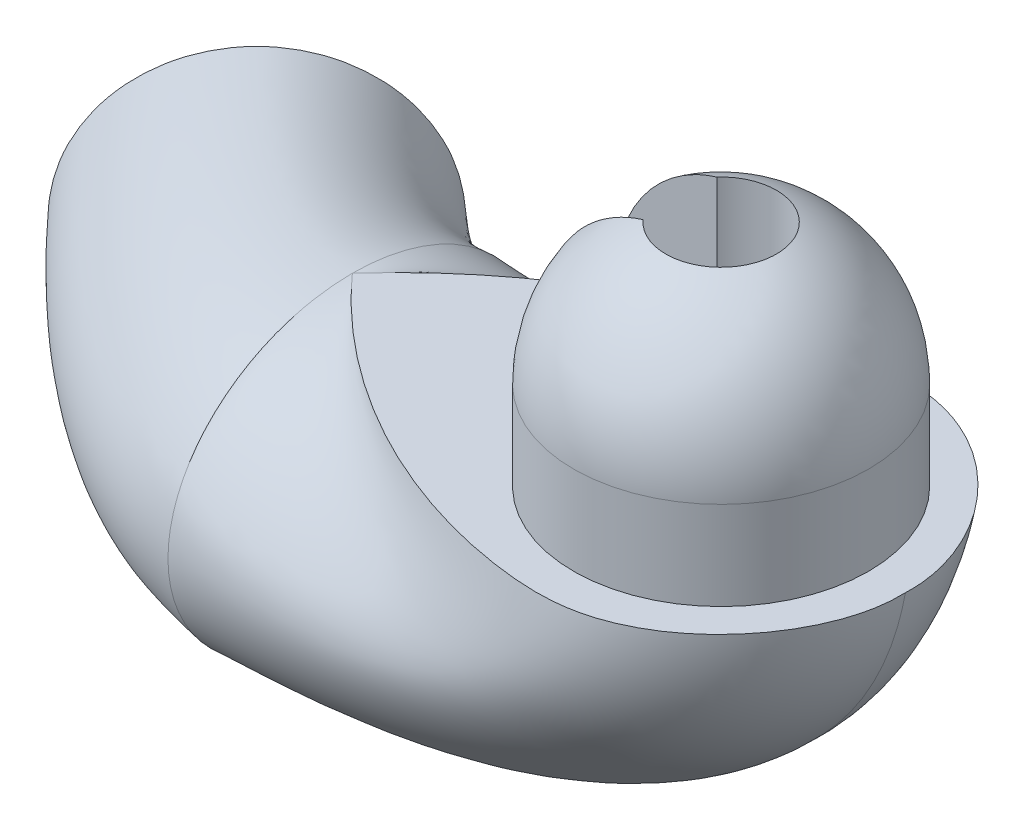
ISO-10303-21;
HEADER;
FILE_DESCRIPTION(('STEP AP214'),'2;1');
FILE_NAME('part.step','',(''),(''),'','','');
FILE_SCHEMA(('AUTOMOTIVE_DESIGN { 1 0 10303 214 1 1 1 1 }'));
ENDSEC;
DATA;
#1=APPLICATION_CONTEXT('core data for automotive mechanical design processes');
#2=APPLICATION_PROTOCOL_DEFINITION('international standard','automotive_design',2000,#1);
#3=PRODUCT_CONTEXT('',#1,'mechanical');
#4=PRODUCT('Part','Part','',(#3));
#5=PRODUCT_RELATED_PRODUCT_CATEGORY('part','',(#4));
#6=PRODUCT_DEFINITION_FORMATION('','',#4);
#7=PRODUCT_DEFINITION_CONTEXT('part definition',#1,'design');
#8=PRODUCT_DEFINITION('design','',#6,#7);
#9=PRODUCT_DEFINITION_SHAPE('','',#8);
#10=(LENGTH_UNIT() NAMED_UNIT(*) SI_UNIT(.MILLI.,.METRE.));
#11=(NAMED_UNIT(*) PLANE_ANGLE_UNIT() SI_UNIT($,.RADIAN.));
#12=(NAMED_UNIT(*) SI_UNIT($,.STERADIAN.) SOLID_ANGLE_UNIT());
#13=UNCERTAINTY_MEASURE_WITH_UNIT(LENGTH_MEASURE(1.E-05),#10,'distance_accuracy_value','');
#14=(GEOMETRIC_REPRESENTATION_CONTEXT(3) GLOBAL_UNCERTAINTY_ASSIGNED_CONTEXT((#13)) GLOBAL_UNIT_ASSIGNED_CONTEXT((#10,
#11,#12)) REPRESENTATION_CONTEXT('',''));
#15=CARTESIAN_POINT('',(0.,0.,0.));
#16=DIRECTION('',(0.,0.,1.));
#17=DIRECTION('',(1.,0.,0.));
#18=AXIS2_PLACEMENT_3D('',#15,#16,#17);
#19=CARTESIAN_POINT('',(4.73507473245652,0.,4.98936116941505));
#20=DIRECTION('',(0.,1.,0.));
#21=DIRECTION('',(0.,0.,-1.));
#22=AXIS2_PLACEMENT_3D('',#19,#20,#21);
#23=PLANE('',#22);
#24=CARTESIAN_POINT('',(5.,0.,2.5));
#25=DIRECTION('',(0.,-1.,0.));
#26=DIRECTION('',(0.,0.,-1.));
#27=AXIS2_PLACEMENT_3D('',#24,#25,#26);
#28=CIRCLE('',#27,2.);
#29=CARTESIAN_POINT('',(3.06350832689629,0.,2.));
#30=VERTEX_POINT('',#29);
#31=CARTESIAN_POINT('',(3.06350832689629,0.,3.));
#32=VERTEX_POINT('',#31);
#33=EDGE_CURVE('E109',#30,#32,#28,.T.);
#34=ORIENTED_EDGE('',*,*,#33,.T.);
#35=DIRECTION('',(1.,0.,0.));
#36=VECTOR('',#35,1.);
#37=CARTESIAN_POINT('',(2.6790228958727,0.,3.));
#38=LINE('',#37,#36);
#39=CARTESIAN_POINT('',(4.44098300562505,0.,3.));
#40=VERTEX_POINT('',#39);
#41=EDGE_CURVE('E93',#32,#40,#38,.T.);
#42=ORIENTED_EDGE('',*,*,#41,.T.);
#43=CARTESIAN_POINT('',(5.,0.,2.5));
#44=DIRECTION('',(0.,1.,0.));
#45=DIRECTION('',(0.,0.,1.));
#46=AXIS2_PLACEMENT_3D('',#43,#44,#45);
#47=CIRCLE('',#46,0.75);
#48=CARTESIAN_POINT('',(4.44098300562505,0.,2.));
#49=VERTEX_POINT('',#48);
#50=EDGE_CURVE('E101',#40,#49,#47,.T.);
#51=ORIENTED_EDGE('',*,*,#50,.T.);
#52=DIRECTION('',(-1.,0.,0.));
#53=VECTOR('',#52,1.);
#54=CARTESIAN_POINT('',(4.44098300562505,0.,2.));
#55=LINE('',#54,#53);
#56=EDGE_CURVE('E98',#49,#30,#55,.T.);
#57=ORIENTED_EDGE('',*,*,#56,.T.);
#58=EDGE_LOOP('',(#34,#42,#51,#57));
#59=FACE_BOUND('',#58,.T.);
#60=CARTESIAN_POINT('',(7.5,0.,2.49999999999999));
#61=CARTESIAN_POINT('',(7.50823058996346,0.,2.68160312823165));
#62=CARTESIAN_POINT('',(7.46344380636916,0.,3.02850424136115));
#63=CARTESIAN_POINT('',(7.23330123988562,0.,3.64143178730474));
#64=CARTESIAN_POINT('',(6.86621771406725,0.,4.14920933028272));
#65=CARTESIAN_POINT('',(6.39822178057757,0.,4.55577936255793));
#66=CARTESIAN_POINT('',(5.99170763089045,0.,4.79874490778828));
#67=CARTESIAN_POINT('',(5.52857314560845,0.,4.96506001367999));
#68=CARTESIAN_POINT('',(5.1817895453393,0.,5.));
#69=CARTESIAN_POINT('',(4.78000040421905,0.,5.));
#70=CARTESIAN_POINT('',(4.32877073926575,0.,4.95378775654363));
#71=CARTESIAN_POINT('',(3.63304559323961,0.,4.80332689979681));
#72=CARTESIAN_POINT('',(2.93444095803466,0.,4.56768487752718));
#73=CARTESIAN_POINT('',(2.0225358724664,0.,4.15441549125842));
#74=CARTESIAN_POINT('',(0.969478991949337,0.,3.47175607058277));
#75=CARTESIAN_POINT('',(0.293338087820461,0.,2.82795129944699));
#76=CARTESIAN_POINT('',(0.,0.,2.5));
#77=B_SPLINE_CURVE_WITH_KNOTS('',3,(#60,#61,#62,#63,#64,#65,#66,#67,#68,#69,#70,#71,#72,#73,#74,
#75,#76),.UNSPECIFIED.,.F.,.F.,(4,1,1,1,1,1,1,2,1,1,1,1,1,4),(0.,0.0565562756208527,
0.113112551241705,0.226225102483411,0.282781378104263,0.339337653725116,0.395893929345969,
0.452450204966821,0.520893929345969,0.589337653725116,0.657781378104263,0.726225102483411,
0.863112551241705,1.),.UNSPECIFIED.);
#78=CARTESIAN_POINT('',(0.,1.2928250840123E-08,2.49971507284762));
#79=VERTEX_POINT('',#78);
#80=CARTESIAN_POINT('',(7.5,0.,2.5));
#81=VERTEX_POINT('',#80);
#82=EDGE_CURVE('E132',#79,#81,#77,.F.);
#83=ORIENTED_EDGE('',*,*,#82,.T.);
#84=CARTESIAN_POINT('',(0.,0.,2.5));
#85=CARTESIAN_POINT('',(0.293338103829924,0.,2.17204868265447));
#86=CARTESIAN_POINT('',(0.96947906081587,0.,1.52824387361764));
#87=CARTESIAN_POINT('',(2.0225358825626,0.,0.845584510287323));
#88=CARTESIAN_POINT('',(2.93444092301905,0.,0.432315135350582));
#89=CARTESIAN_POINT('',(3.63304553826115,0.,0.196673117505334));
#90=CARTESIAN_POINT('',(4.3287706849955,0.,0.0462122499199591));
#91=CARTESIAN_POINT('',(4.78000039221216,0.,0.));
#92=CARTESIAN_POINT('',(5.18178952789119,0.,0.));
#93=CARTESIAN_POINT('',(5.52857310613618,0.,0.0349399784608431));
#94=CARTESIAN_POINT('',(5.99170759816834,0.,0.201255075385112));
#95=CARTESIAN_POINT('',(6.39822176321519,0.,0.444220623691196));
#96=CARTESIAN_POINT('',(6.86621772138046,0.,0.850790673414314));
#97=CARTESIAN_POINT('',(7.23330125921473,0.,1.35856824306579));
#98=CARTESIAN_POINT('',(7.46344381568126,0.,1.97149579834312));
#99=CARTESIAN_POINT('',(7.50823058917349,0.,2.31839688919857));
#100=CARTESIAN_POINT('',(7.5,0.,2.50000000000001));
#101=B_SPLINE_CURVE_WITH_KNOTS('',3,(#84,#85,#86,#87,#88,#89,#90,#91,#92,#93,#94,#95,#96,#97,
#98,#99,#100),.UNSPECIFIED.,.F.,.F.,(4,1,1,1,1,1,2,1,1,1,1,1,1,4),(0.,0.136887461139135,
0.273774922278271,0.342218652847838,0.410662383417406,0.479106113986974,0.547549844556541,
0.604106113986974,0.660662383417406,0.717218652847838,0.773774922278271,0.886887461139135,
0.943443730569568,1.),.UNSPECIFIED.);
#102=EDGE_CURVE('E123',#81,#79,#101,.F.);
#103=ORIENTED_EDGE('',*,*,#102,.T.);
#104=EDGE_LOOP('',(#83,#103));
#105=FACE_BOUND('',#104,.T.);
#106=ADVANCED_FACE('F32',(#59,#105),#23,.T.);
#107=CARTESIAN_POINT('',(-3.31225624165787,-2.,0.483829116911674));
#108=DIRECTION('',(0.707106781186546,0.,0.707106781186549));
#109=DIRECTION('',(0.707106781186549,0.,-0.707106781186546));
#110=AXIS2_PLACEMENT_3D('',#107,#108,#109);
#111=PLANE('',#110);
#112=CARTESIAN_POINT('',(-3.31225624165787,-2.,0.483829116911674));
#113=DIRECTION('',(-0.707106781186546,0.,-0.707106781186549));
#114=DIRECTION('',(-0.707106781186549,0.,0.707106781186546));
#115=AXIS2_PLACEMENT_3D('',#112,#113,#114);
#116=ELLIPSE('',#115,2.,2.);
#117=CARTESIAN_POINT('',(-4.72646980403097,-2.,1.89804267928477));
#118=VERTEX_POINT('',#117);
#119=EDGE_CURVE('E259',#118,#118,#116,.T.);
#120=ORIENTED_EDGE('',*,*,#119,.T.);
#121=EDGE_LOOP('',(#120));
#122=FACE_BOUND('',#121,.T.);
#123=CARTESIAN_POINT('',(-3.31225624165787,-2.,0.483829116911674));
#124=DIRECTION('',(-0.707106781186546,0.,-0.707106781186549));
#125=DIRECTION('',(0.707106781186549,0.,-0.707106781186546));
#126=AXIS2_PLACEMENT_3D('',#123,#124,#125);
#127=CIRCLE('',#126,1.125);
#128=CARTESIAN_POINT('',(-2.516761112823,-2.,-0.31166601192319));
#129=VERTEX_POINT('',#128);
#130=EDGE_CURVE('E124',#129,#129,#127,.T.);
#131=ORIENTED_EDGE('',*,*,#130,.F.);
#132=EDGE_LOOP('',(#131));
#133=FACE_BOUND('',#132,.T.);
#134=ADVANCED_FACE('F204',(#122,#133),#111,.F.);
#135=CARTESIAN_POINT('',(0.,-4.2,2.49999997011014));
#136=CARTESIAN_POINT('',(-0.146742611688297,-4.20286550461975,2.48179723035606));
#137=CARTESIAN_POINT('',(-1.12222066506903,-4.1789003750892,2.30069532329818));
#138=CARTESIAN_POINT('',(-1.95948753838525,-4.17445859906967,2.03247373475735));
#139=CARTESIAN_POINT('',(-3.31225624165787,-4.,0.483829116911673));
#140=CARTESIAN_POINT('',(0.,-4.2,2.19836129227853));
#141=CARTESIAN_POINT('',(-0.139655756541813,-4.20286550461975,2.18406290197288));
#142=CARTESIAN_POINT('',(-1.04755878022122,-4.1789003750892,2.04365442456356));
#143=CARTESIAN_POINT('',(-1.82449953616029,-4.17445859906967,1.8156706481727));
#144=CARTESIAN_POINT('',(-3.12713612960674,-4.,0.298709004860543));
#145=CARTESIAN_POINT('',(0.,-4.10833507935549,1.59472909886228));
#146=CARTESIAN_POINT('',(-0.120973982876845,-4.11002144089427,1.58594662839158));
#147=CARTESIAN_POINT('',(-0.904573863692059,-4.08061234565118,1.50178683907874));
#148=CARTESIAN_POINT('',(-1.55258827534835,-4.06638287744619,1.33493326701403));
#149=CARTESIAN_POINT('',(-2.75696375909292,-3.89598215796163,-0.0714633656532701));
#150=CARTESIAN_POINT('',(0.,-3.69371629660239,0.776500214039875));
#151=CARTESIAN_POINT('',(-0.0893458189282706,-3.69209060756782,0.772432772687611));
#152=CARTESIAN_POINT('',(-0.733092205662598,-3.64860340188294,0.733123212621852));
#153=CARTESIAN_POINT('',(-1.20291843988814,-3.6072646438174,0.627302127550897));
#154=CARTESIAN_POINT('',(-2.2861976535332,-3.45106597111442,-0.542229471213002));
#155=CARTESIAN_POINT('',(0.,-3.00272511026058,0.160766285967962));
#156=CARTESIAN_POINT('',(-0.063610221964274,-2.99963819662749,0.159854172326594));
#157=CARTESIAN_POINT('',(-0.623958643141196,-2.96058114025006,0.148560376060056));
#158=CARTESIAN_POINT('',(-0.966615544216336,-2.91064135207322,0.0872790256589414));
#159=CARTESIAN_POINT('',(-1.97159440075428,-2.78530215992626,-0.856832723991904));
#160=CARTESIAN_POINT('',(0.,-2.40163870772189,0.));
#161=CARTESIAN_POINT('',(-0.0561900803845833,-2.40037053557888,-0.000301631636904407));
#162=CARTESIAN_POINT('',(-0.599911396905172,-2.38584835920112,-0.00687602085754774));
#163=CARTESIAN_POINT('',(-0.910444623419121,-2.35609972455105,-0.0578730217352386));
#164=CARTESIAN_POINT('',(-1.89804267928477,-2.26179937313036,-0.930384445461419));
#165=CARTESIAN_POINT('',(0.,-1.7983613221811,0.));
#166=CARTESIAN_POINT('',(-0.0561900803845833,-1.79974910381625,-0.000301631636904211));
#167=CARTESIAN_POINT('',(-0.599911396905172,-1.81178646522161,-0.00687602085754752));
#168=CARTESIAN_POINT('',(-0.910444623419121,-1.80859736835465,-0.0578730217352383));
#169=CARTESIAN_POINT('',(-1.89804267928477,-1.73820060093892,-0.930384445461418));
#170=CARTESIAN_POINT('',(0.,-1.19727492933299,0.160766259464055));
#171=CARTESIAN_POINT('',(-0.0548917199946969,-1.20082468843853,0.162729750023182));
#172=CARTESIAN_POINT('',(-0.593725373143239,-1.2347118814175,0.171075370974304));
#173=CARTESIAN_POINT('',(-0.973911339668054,-1.25527592340819,0.0503136387346895));
#174=CARTESIAN_POINT('',(-1.97159441350193,-1.21469780349391,-0.856832711244266));
#175=CARTESIAN_POINT('',(0.,-0.506283697054256,0.776500209636346));
#176=CARTESIAN_POINT('',(-0.054471809498738,-0.509401944448522,0.783935180112972));
#177=CARTESIAN_POINT('',(-0.61215910848492,-0.539664190919537,0.823183239125599));
#178=CARTESIAN_POINT('',(-1.23210158860519,-0.56231320825439,0.479440576925317));
#179=CARTESIAN_POINT('',(-2.28619765696574,-0.548934033738167,-0.542229467780446));
#180=CARTESIAN_POINT('',(0.,-0.0916649048201302,1.5947291423194));
#181=CARTESIAN_POINT('',(-0.0599444653893786,-0.0925008123711799,1.60607588977972));
#182=CARTESIAN_POINT('',(-0.692940932512134,-0.100629831013785,1.6593919060208));
#183=CARTESIAN_POINT('',(-1.60365876374493,-0.106855542372347,1.07617554618459));
#184=CARTESIAN_POINT('',(-2.75696373322839,-0.104017860065657,-0.0714633915178119));
#185=CARTESIAN_POINT('',(0.,0.,2.1983613221807));
#186=CARTESIAN_POINT('',(-0.0699077370469979,0.,2.20706775339796));
#187=CARTESIAN_POINT('',(-0.805692578138338,0.,2.2237744924289));
#188=CARTESIAN_POINT('',(-1.88286581715893,0.,1.51994754016445));
#189=CARTESIAN_POINT('',(-3.12713611127149,0.,0.298708986525293));
#190=CARTESIAN_POINT('',(0.,0.,2.80163870772319));
#191=CARTESIAN_POINT('',(-0.0840814480419639,0.,2.80253643965677));
#192=CARTESIAN_POINT('',(-0.955016355229448,0.,2.73785631535882));
#193=CARTESIAN_POINT('',(-2.15284183497922,0.,1.95355373480779));
#194=CARTESIAN_POINT('',(-3.49737635370901,0.,0.668949228962813));
#195=CARTESIAN_POINT('',(0.,-0.0916649206455884,3.4052709011433));
#196=CARTESIAN_POINT('',(-0.0875872606806623,-0.0924571178085326,3.40131011932424));
#197=CARTESIAN_POINT('',(-0.977480993420405,-0.100186966034652,3.29493919639107));
#198=CARTESIAN_POINT('',(-2.32620520636502,-0.107938520074303,2.5310945458628));
#199=CARTESIAN_POINT('',(-3.86754872422255,-0.104017842038337,1.03912159947635));
#200=CARTESIAN_POINT('',(0.,-0.506283703404131,4.22349978597012));
#201=CARTESIAN_POINT('',(-0.0736875415503121,-0.509227113386236,4.21679619327979));
#202=CARTESIAN_POINT('',(-0.787401816434423,-0.53789271959392,4.10924870948619));
#203=CARTESIAN_POINT('',(-2.38023137354631,-0.566645149055742,3.52913597501362));
#204=CARTESIAN_POINT('',(-4.33831482978188,-0.548934028884766,1.50988770503568));
#205=CARTESIAN_POINT('',(0.,-1.19727488975452,4.83923371404141));
#206=CARTESIAN_POINT('',(-0.0538952554353766,-1.20051868658087,4.83134701188757));
#207=CARTESIAN_POINT('',(-0.534974543940408,-1.23161179101987,4.73945743268341));
#208=CARTESIAN_POINT('',(-2.32089060093949,-1.26285683615362,4.3595693665924));
#209=CARTESIAN_POINT('',(-4.65291808256107,-1.21469784007231,1.82449095781486));
#210=CARTESIAN_POINT('',(0.,-1.79836129229778,5.00000000000351));
#211=CARTESIAN_POINT('',(-0.0461394359887617,-1.79939940171593,4.99216022192788));
#212=CARTESIAN_POINT('',(-0.438501511838035,-1.80824350866791,4.91010912514281));
#213=CARTESIAN_POINT('',(-2.27851363231067,-1.81726126212817,4.60152484388083));
#214=CARTESIAN_POINT('',(-4.72646980403097,-1.73820062686889,1.89804267928477));
#215=CARTESIAN_POINT('',(0.,-2.40163867783856,4.99999999999649));
#216=CARTESIAN_POINT('',(-0.0461394359887617,-2.40002083347856,4.99216022192112));
#217=CARTESIAN_POINT('',(-0.438501511838035,-2.38230540264743,4.91010912513858));
#218=CARTESIAN_POINT('',(-2.27851363231067,-2.36476361832457,4.60152484387891));
#219=CARTESIAN_POINT('',(-4.72646980403097,-2.26179939906034,1.89804267928477));
#220=CARTESIAN_POINT('',(0.,-3.00272507068211,4.83923374052658));
#221=CARTESIAN_POINT('',(-0.0626137574049408,-2.99933219476982,4.82847143417294));
#222=CARTESIAN_POINT('',(-0.565207813938365,-2.95748104985242,4.71694243775809));
#223=CARTESIAN_POINT('',(-2.31359480548809,-2.91822226481865,4.3965347535121));
#224=CARTESIAN_POINT('',(-4.65291806981422,-2.78530219650464,1.82449094506801));
#225=CARTESIAN_POINT('',(0.,-3.69371630295224,4.22349979035368));
#226=CARTESIAN_POINT('',(-0.108561550979761,-3.69191577650552,4.20529378583522));
#227=CARTESIAN_POINT('',(-0.908334913611638,-3.64683193055731,4.01918868297089));
#228=CARTESIAN_POINT('',(-2.35104822482944,-3.61159658461875,3.67699752563491));
#229=CARTESIAN_POINT('',(-4.33831482635066,-3.45106596626102,1.50988770160447));
#230=CARTESIAN_POINT('',(0.,-4.10833509518095,3.40527085767503));
#231=CARTESIAN_POINT('',(-0.148616778167991,-4.10997774633162,3.38118085792536));
#232=CARTESIAN_POINT('',(-1.18911392459937,-4.08016948067204,3.13733412944258));
#233=CARTESIAN_POINT('',(-2.2751347179679,-4.06746585514814,2.78985226668994));
#234=CARTESIAN_POINT('',(-3.86754875008765,-3.8959821399343,1.03912162534144));
#235=CARTESIAN_POINT('',(0.,-4.2,2.80163867781761));
#236=CARTESIAN_POINT('',(-0.1538294675367,-4.20286550461975,2.77953158822839));
#237=CARTESIAN_POINT('',(-1.19688255731175,-4.1789003750892,2.55773624749147));
#238=CARTESIAN_POINT('',(-2.09447555398012,-4.17445859906967,2.2492768428153));
#239=CARTESIAN_POINT('',(-3.49737637204426,-4.,0.668949247298062));
#240=CARTESIAN_POINT('',(0.,-4.2,2.49999997011014));
#241=CARTESIAN_POINT('',(-0.146742611688297,-4.20286550461975,2.48179723035606));
#242=CARTESIAN_POINT('',(-1.12222066506903,-4.1789003750892,2.30069532329818));
#243=CARTESIAN_POINT('',(-1.95948753838525,-4.17445859906967,2.03247373475735));
#244=CARTESIAN_POINT('',(-3.31225624165787,-4.,0.483829116911673));
#245=B_SPLINE_SURFACE_WITH_KNOTS('',3,3,((#135,#136,#137,#138,#139),(#140,#141,#142,#143,#144),
(#145,#146,#147,#148,#149),(#150,#151,#152,#153,#154),(#155,#156,#157,#158,#159),(#160,#161,
#162,#163,#164),(#165,#166,#167,#168,#169),(#170,#171,#172,#173,#174),(#175,#176,#177,#178,
#179),(#180,#181,#182,#183,#184),(#185,#186,#187,#188,#189),(#190,#191,#192,#193,#194),(#195,
#196,#197,#198,#199),(#200,#201,#202,#203,#204),(#205,#206,#207,#208,#209),(#210,#211,#212,#213,
#214),(#215,#216,#217,#218,#219),(#220,#221,#222,#223,#224),(#225,#226,#227,#228,#229),(#230,
#231,#232,#233,#234),(#235,#236,#237,#238,#239),(#240,#241,#242,#243,#244)),.UNSPECIFIED.,.T.,
.F.,.F.,(4,1,1,1,2,1,1,1,2,1,1,1,2,1,1,1,4),(4,1,4),(0.,0.0624999969047489,0.124999993809498,
0.187499990714247,0.249999987618996,0.312499990714247,0.374999993809498,0.437499996904749,
0.500000000000001,0.562499996904927,0.624999993809853,0.687499990714779,0.749999987619705,
0.812499990714778,0.874999993809852,0.937499996904926,1.),(0.,0.0999999999941863,1.),.UNSPECIFIED.);
#246=CARTESIAN_POINT('',(0.,-2.1,2.5));
#247=DIRECTION('',(-1.,0.,0.));
#248=DIRECTION('',(0.,0.,-1.));
#249=AXIS2_PLACEMENT_3D('',#246,#247,#248);
#250=ELLIPSE('',#249,2.5,2.1);
#251=CARTESIAN_POINT('',(0.,-4.2,2.49999998505507));
#252=VERTEX_POINT('',#251);
#253=EDGE_CURVE('E186',#252,#79,#250,.T.);
#254=CARTESIAN_POINT('',(0.,-4.2,2.49999997011014));
#255=CARTESIAN_POINT('',(0.,-4.2,2.80163867781761));
#256=CARTESIAN_POINT('',(0.,-4.10833509518095,3.40527085767503));
#257=CARTESIAN_POINT('',(0.,-3.69371630295224,4.22349979035368));
#258=CARTESIAN_POINT('',(0.,-3.00272507068211,4.83923374052658));
#259=CARTESIAN_POINT('',(0.,-2.40163867783856,4.99999999999649));
#260=CARTESIAN_POINT('',(0.,-1.79836129229778,5.00000000000351));
#261=CARTESIAN_POINT('',(0.,-1.19727488975452,4.83923371404141));
#262=CARTESIAN_POINT('',(0.,-0.506283703404131,4.22349978597012));
#263=CARTESIAN_POINT('',(0.,-0.0916649206455884,3.4052709011433));
#264=CARTESIAN_POINT('',(0.,0.,2.80163870772319));
#265=CARTESIAN_POINT('',(0.,0.,2.1983613221807));
#266=CARTESIAN_POINT('',(0.,-0.0916649048201302,1.5947291423194));
#267=CARTESIAN_POINT('',(0.,-0.506283697054256,0.776500209636346));
#268=CARTESIAN_POINT('',(0.,-1.19727492933299,0.160766259464055));
#269=CARTESIAN_POINT('',(0.,-1.7983613221811,0.));
#270=CARTESIAN_POINT('',(0.,-2.40163870772189,0.));
#271=CARTESIAN_POINT('',(0.,-3.00272511026058,0.160766285967962));
#272=CARTESIAN_POINT('',(0.,-3.69371629660239,0.776500214039875));
#273=CARTESIAN_POINT('',(0.,-4.10833507935549,1.59472909886228));
#274=CARTESIAN_POINT('',(0.,-4.2,2.19836129227853));
#275=CARTESIAN_POINT('',(0.,-4.2,2.49999997011014));
#276=B_SPLINE_CURVE_WITH_KNOTS('',3,(#254,#255,#256,#257,#258,#259,#260,#261,#262,#263,#264,
#265,#266,#267,#268,#269,#270,#271,#272,#273,#274,#275),.UNSPECIFIED.,.T.,.F.,(4,1,1,1,2,1,1,1,
2,1,1,1,2,1,1,1,4),(0.,0.0625000030950739,0.125000006190148,0.187500009285222,0.250000012380295,
0.312500009285221,0.375000006190147,0.437500003095073,0.499999999999999,0.562500003095251,
0.625000006190502,0.687500009285753,0.750000012381004,0.812500009285753,0.875000006190502,
0.937500003095251,1.),.UNSPECIFIED.);
#277=EDGE_CURVE('E61',#79,#252,#276,.T.);
#278=ORIENTED_EDGE('',*,*,#253,.T.);
#279=ORIENTED_EDGE('',*,*,#277,.T.);
#280=EDGE_LOOP('',(#278,#279));
#281=FACE_BOUND('',#280,.T.);
#282=ORIENTED_EDGE('',*,*,#119,.F.);
#283=EDGE_LOOP('',(#282));
#284=FACE_BOUND('',#283,.T.);
#285=ADVANCED_FACE('F152',(#281,#284),#245,.F.);
#286=CARTESIAN_POINT('',(0.,-4.2,2.5));
#287=CARTESIAN_POINT('',(0.105781777957206,-4.1979343547867,2.51312176002954));
#288=CARTESIAN_POINT('',(1.4192393709244,-4.14993393507288,2.64482044491097));
#289=CARTESIAN_POINT('',(7.08014247247718,-3.62406705762578,2.81743268927057));
#290=CARTESIAN_POINT('',(7.5,0.,2.49999999999999));
#291=CARTESIAN_POINT('',(0.,-4.2,2.63647647485788));
#292=CARTESIAN_POINT('',(0.106056130955982,-4.1979343547867,2.65110245666651));
#293=CARTESIAN_POINT('',(1.42225725391099,-4.14993393507288,2.7978433593392));
#294=CARTESIAN_POINT('',(7.08590388545159,-3.62406705762578,2.98549782149005));
#295=CARTESIAN_POINT('',(7.50823058996346,0.,2.68160312823165));
#296=CARTESIAN_POINT('',(0.,-4.18119654722982,2.91880778398276));
#297=CARTESIAN_POINT('',(0.105062778304238,-4.17765981231065,2.93544418715239));
#298=CARTESIAN_POINT('',(1.40708209944928,-4.11758558032943,3.10213750174085));
#299=CARTESIAN_POINT('',(7.03864678014114,-3.59229630136862,3.31488341729668));
#300=CARTESIAN_POINT('',(7.46344380636916,0.,3.02850424136115));
#301=CARTESIAN_POINT('',(0.,-4.0541916623502,3.5018464952999));
#302=CARTESIAN_POINT('',(0.100077603236646,-4.04439148571377,3.5187696657616));
#303=CARTESIAN_POINT('',(1.33042573047503,-3.9339482010934,3.68757164479663));
#304=CARTESIAN_POINT('',(6.79856320373426,-3.42208185181585,3.92812143224515));
#305=CARTESIAN_POINT('',(7.23330123988562,0.,3.64143178730474));
#306=CARTESIAN_POINT('',(0.,-3.77181355607381,4.08374332936444));
#307=CARTESIAN_POINT('',(0.0925919793533299,-3.75461268903872,4.09706061327724));
#308=CARTESIAN_POINT('',(1.21178539834615,-3.58757894107068,4.22858931326387));
#309=CARTESIAN_POINT('',(6.41654589772116,-3.12247312869072,4.47297815357775));
#310=CARTESIAN_POINT('',(6.86621771406725,0.,4.14920933028272));
#311=CARTESIAN_POINT('',(0.,-3.3296799989235,4.5481344861156));
#312=CARTESIAN_POINT('',(0.0828738673968581,-3.31035813985225,4.55838915569983));
#313=CARTESIAN_POINT('',(1.06511929680365,-3.13401055562439,4.65807729884168));
#314=CARTESIAN_POINT('',(5.96717793096125,-2.76615147855342,4.91173791422447));
#315=CARTESIAN_POINT('',(6.39822178057757,0.,4.55577936255793));
#316=CARTESIAN_POINT('',(0.,-2.94130297249896,4.81225005335053));
#317=CARTESIAN_POINT('',(0.0740670917902432,-2.92382790786801,4.82105471864605));
#318=CARTESIAN_POINT('',(0.939438068703537,-2.76944229469017,4.90544586000282));
#319=CARTESIAN_POINT('',(5.60527469917771,-2.49598304135778,5.17078944141887));
#320=CARTESIAN_POINT('',(5.99170763089045,0.,4.79874490778828));
#321=CARTESIAN_POINT('',(0.,-2.51924995438778,4.96676285858527));
#322=CARTESIAN_POINT('',(0.0634721055986542,-2.50785691195072,4.97542878850609));
#323=CARTESIAN_POINT('',(0.797857636650451,-2.40968965276874,5.05786331976034));
#324=CARTESIAN_POINT('',(5.23006278613679,-2.24831666848286,5.34052169665837));
#325=CARTESIAN_POINT('',(5.52857314560845,0.,4.96506001367999));
#326=CARTESIAN_POINT('',(0.,-2.2364764748784,4.99999999999841));
#327=CARTESIAN_POINT('',(0.0550517963726515,-2.23230521584915,5.00858078597704));
#328=CARTESIAN_POINT('',(0.692893025117255,-2.1961120436159,5.09001207611462));
#329=CARTESIAN_POINT('',(4.97907996660789,-2.11685355678739,5.37680625338512));
#330=CARTESIAN_POINT('',(5.1817895453393,0.,5.));
#331=CARTESIAN_POINT('',(0.,-1.9348377792685,5.00000000000192));
#332=CARTESIAN_POINT('',(0.044992551267927,-1.9405871078049,5.00858078598043));
#333=CARTESIAN_POINT('',(0.572020239230303,-1.98733177708318,5.09001207611705));
#334=CARTESIAN_POINT('',(4.70751710444612,-2.00046947300333,5.37680625338648));
#335=CARTESIAN_POINT('',(4.78000040421905,0.,5.));
#336=CARTESIAN_POINT('',(0.,-1.61841314093148,4.9539276381165));
#337=CARTESIAN_POINT('',(0.0363198271575806,-1.63240245463583,4.96223561181415));
#338=CARTESIAN_POINT('',(0.465641105292898,-1.74824317049256,5.04107554694384));
#339=CARTESIAN_POINT('',(4.35723299098797,-1.83945734114242,5.31886077898333));
#340=CARTESIAN_POINT('',(4.32877073926575,0.,4.95378775654363));
#341=CARTESIAN_POINT('',(0.,-1.19638420218133,4.77586220881276));
#342=CARTESIAN_POINT('',(0.0286246370795253,-1.21612515248439,4.78408477407209));
#343=CARTESIAN_POINT('',(0.365531308959529,-1.38051206326045,4.86258350407459));
#344=CARTESIAN_POINT('',(3.71676567576151,-1.53015840369539,5.11596156765095));
#345=CARTESIAN_POINT('',(3.63304559323961,0.,4.80332689979681));
#346=CARTESIAN_POINT('',(0.,-0.83787189144089,4.51810009222563));
#347=CARTESIAN_POINT('',(0.0245674587476029,-0.858019937620774,4.52565220876259));
#348=CARTESIAN_POINT('',(0.306809909689242,-1.02594477199833,4.59816448249947));
#349=CARTESIAN_POINT('',(3.00573640278804,-1.18597786855907,4.81186374113997));
#350=CARTESIAN_POINT('',(2.93444095803466,0.,4.56768487752718));
#351=CARTESIAN_POINT('',(0.,-0.443578783461024,4.09060033484364));
#352=CARTESIAN_POINT('',(0.0218431308798902,-0.45934564853407,4.09648160058971));
#353=CARTESIAN_POINT('',(0.260365037119713,-0.590599605245449,4.15337950882997));
#354=CARTESIAN_POINT('',(2.02437088562114,-0.71977411107667,4.30012368019067));
#355=CARTESIAN_POINT('',(2.0225358724664,0.,4.15441549125842));
#356=CARTESIAN_POINT('',(0.,-0.105883227239584,3.44115384907783));
#357=CARTESIAN_POINT('',(0.0196205754473538,-0.11107005919907,3.4432465213753));
#358=CARTESIAN_POINT('',(0.220567115695064,-0.15380068786667,3.4636261731442));
#359=CARTESIAN_POINT('',(0.853467212868302,-0.196861993569539,3.50967618580465));
#360=CARTESIAN_POINT('',(0.969478991949337,0.,3.47175607058277));
#361=CARTESIAN_POINT('',(0.,-1.35437186879012E-12,2.83032444151626));
#362=CARTESIAN_POINT('',(0.00977793626044747,-1.30922613983153E-12,2.83024533678062));
#363=CARTESIAN_POINT('',(0.107557298867268,-8.57768850234826E-13,2.8294542894242));
#364=CARTESIAN_POINT('',(0.205336661474088,-4.06311560638119E-13,2.82866324206778));
#365=CARTESIAN_POINT('',(0.293338087820461,0.,2.82795129944699));
#366=CARTESIAN_POINT('',(0.,0.,2.50000000001222));
#367=CARTESIAN_POINT('',(0.,0.,2.50000000001181));
#368=CARTESIAN_POINT('',(0.,0.,2.50000000000774));
#369=CARTESIAN_POINT('',(0.,0.,2.50000000000367));
#370=CARTESIAN_POINT('',(0.,0.,2.5));
#371=B_SPLINE_SURFACE_WITH_KNOTS('',3,3,((#286,#287,#288,#289,#290),(#291,#292,#293,#294,#295),
(#296,#297,#298,#299,#300),(#301,#302,#303,#304,#305),(#306,#307,#308,#309,#310),(#311,#312,
#313,#314,#315),(#316,#317,#318,#319,#320),(#321,#322,#323,#324,#325),(#326,#327,#328,#329,
#330),(#331,#332,#333,#334,#335),(#336,#337,#338,#339,#340),(#341,#342,#343,#344,#345),(#346,
#347,#348,#349,#350),(#351,#352,#353,#354,#355),(#356,#357,#358,#359,#360),(#361,#362,#363,#364,
#365),(#366,#367,#368,#369,#370)),.UNSPECIFIED.,.F.,.F.,.F.,(4,1,1,1,1,1,1,2,1,1,1,1,1,4),(4,1,
4),(0.,0.0565562756208527,0.113112551241705,0.226225102483411,0.282781378104263,
0.339337653725116,0.395893929345969,0.452450204966821,0.520893929345969,0.589337653725116,
0.657781378104263,0.726225102483411,0.863112551241705,1.),(0.,0.099999999997601,1.),.UNSPECIFIED.);
#372=CARTESIAN_POINT('',(0.,-4.2,2.5));
#373=CARTESIAN_POINT('',(0.105781777957206,-4.1979343547867,2.51312176002954));
#374=CARTESIAN_POINT('',(1.4192393709244,-4.14993393507288,2.64482044491097));
#375=CARTESIAN_POINT('',(7.08014247247718,-3.62406705762578,2.81743268927057));
#376=CARTESIAN_POINT('',(7.5,0.,2.49999999999999));
#377=B_SPLINE_CURVE_WITH_KNOTS('',3,(#372,#373,#374,#375,#376),.UNSPECIFIED.,.F.,.F.,(4,1,4),
(0.,0.099999999997601,1.),.UNSPECIFIED.);
#378=EDGE_CURVE('E137',#81,#252,#377,.F.);
#379=ORIENTED_EDGE('',*,*,#253,.F.);
#380=ORIENTED_EDGE('',*,*,#378,.F.);
#381=ORIENTED_EDGE('',*,*,#82,.F.);
#382=EDGE_LOOP('',(#379,#380,#381));
#383=FACE_BOUND('',#382,.T.);
#384=ADVANCED_FACE('F139',(#383),#371,.F.);
#385=CARTESIAN_POINT('',(0.,0.,2.50000000001222));
#386=CARTESIAN_POINT('',(0.,0.,2.50000000001181));
#387=CARTESIAN_POINT('',(0.,0.,2.50000000000774));
#388=CARTESIAN_POINT('',(0.,0.,2.50000000000367));
#389=CARTESIAN_POINT('',(0.,0.,2.5));
#390=CARTESIAN_POINT('',(0.,1.35784116987904E-12,2.16967559403792));
#391=CARTESIAN_POINT('',(0.00977793679409622,1.31257979755083E-12,2.1697546969918));
#392=CARTESIAN_POINT('',(0.107557304737404,8.59966074257813E-13,2.17054572653065));
#393=CARTESIAN_POINT('',(0.205336672680712,4.07352350964799E-13,2.1713367560695));
#394=CARTESIAN_POINT('',(0.293338103829924,0.,2.17204868265447));
#395=CARTESIAN_POINT('',(0.,-0.105883210677071,1.55884618883736));
#396=CARTESIAN_POINT('',(0.046785292325549,-0.111066176145206,1.55801561838946));
#397=CARTESIAN_POINT('',(0.572045512421883,-0.157083105562118,1.53847420968181));
#398=CARTESIAN_POINT('',(0.855681494149333,-0.0944834771617563,1.54691139181567));
#399=CARTESIAN_POINT('',(0.96947906081587,0.,1.52824387361764));
#400=CARTESIAN_POINT('',(0.,-0.443578776925178,0.909399669526774));
#401=CARTESIAN_POINT('',(0.118060495464086,-0.459286238078528,0.907935771093408));
#402=CARTESIAN_POINT('',(1.49959098903694,-0.596016311185912,0.85397182195981));
#403=CARTESIAN_POINT('',(2.0354366483187,-0.352588431932835,0.897932940771528));
#404=CARTESIAN_POINT('',(2.0225358825626,0.,0.845584510287323));
#405=CARTESIAN_POINT('',(0.,-0.837871906372763,0.481899893110981));
#406=CARTESIAN_POINT('',(0.177395977410163,-0.857861074859413,0.481289354845704));
#407=CARTESIAN_POINT('',(2.26709588411725,-1.02578277076948,0.413387598936296));
#408=CARTESIAN_POINT('',(3.02786247979548,-0.596313398684526,0.499368092655243));
#409=CARTESIAN_POINT('',(2.93444092301905,0.,0.432315135350582));
#410=CARTESIAN_POINT('',(0.,-1.19638423191904,0.22413777234123));
#411=CARTESIAN_POINT('',(0.21967378518528,-1.21585802219838,0.224513298418046));
#412=CARTESIAN_POINT('',(2.80749884674256,-1.37099673412393,0.151725324129972));
#413=CARTESIAN_POINT('',(3.74925878441183,-0.786185145919294,0.269541499949746));
#414=CARTESIAN_POINT('',(3.63304553826115,0.,0.196673117505334));
#415=CARTESIAN_POINT('',(0.,-1.61841317616196,0.0460723551393264));
#416=CARTESIAN_POINT('',(0.256429614314635,-1.63198721542682,0.0475456954256924));
#417=CARTESIAN_POINT('',(3.26563230795206,-1.72267898726967,-0.0247976094808016));
#418=CARTESIAN_POINT('',(4.40224715423063,-0.971592436028647,0.119693164634476));
#419=CARTESIAN_POINT('',(4.3287706849955,0.,0.0462122499199591));
#420=CARTESIAN_POINT('',(0.,-1.93483779701285,0.));
#421=CARTESIAN_POINT('',(0.276000521252724,-1.94000314666729,0.00151605380852825));
#422=CARTESIAN_POINT('',(3.49230648803502,-1.94049048789804,-0.0732090419334468));
#423=CARTESIAN_POINT('',(4.76485632158209,-1.07504865031333,0.0758945890567297));
#424=CARTESIAN_POINT('',(4.78000039221216,0.,0.));
#425=CARTESIAN_POINT('',(0.,-2.23647648694374,0.));
#426=CARTESIAN_POINT('',(0.287726820815638,-2.23165899465473,0.00151605380852815));
#427=CARTESIAN_POINT('',(3.62669733795138,-2.14083650746977,-0.0732090419334468));
#428=CARTESIAN_POINT('',(5.04156696674174,-1.1785998910989,0.0758945890567297));
#429=CARTESIAN_POINT('',(5.18178952789119,0.,0.));
#430=CARTESIAN_POINT('',(0.,-2.51924998343517,0.0332371478353647));
#431=CARTESIAN_POINT('',(0.288145346486386,-2.50725818880678,0.0351726409841473));
#432=CARTESIAN_POINT('',(3.63405544016288,-2.35983830924957,-0.0325341014048534));
#433=CARTESIAN_POINT('',(5.2883407204123,-1.34500820980156,0.11787178396161));
#434=CARTESIAN_POINT('',(5.52857310613618,0.,0.0349399784608431));
#435=CARTESIAN_POINT('',(0.,-2.94130300614817,0.187749965087625));
#436=CARTESIAN_POINT('',(0.27156211833572,-2.92330161874752,0.191438911256574));
#437=CARTESIAN_POINT('',(3.43254743068835,-2.72562135964373,0.151856548883381));
#438=CARTESIAN_POINT('',(5.65650288535986,-1.70194576796108,0.308951443103076));
#439=CARTESIAN_POINT('',(5.99170759816834,0.,0.201255075385112));
#440=CARTESIAN_POINT('',(0.,-3.329680017001,0.451865529832219));
#441=CARTESIAN_POINT('',(0.242319393842105,-3.30993323709266,0.456753536630118));
#442=CARTESIAN_POINT('',(3.07790484107416,-3.09863217963631,0.44398757028595));
#443=CARTESIAN_POINT('',(6.00853647330363,-2.12509385963931,0.597889340907061));
#444=CARTESIAN_POINT('',(6.39822176321519,0.,0.444220623691196));
#445=CARTESIAN_POINT('',(0.,-3.77181354724044,0.916256667810958));
#446=CARTESIAN_POINT('',(0.194057315067782,-3.75434227671062,0.922118731555636));
#447=CARTESIAN_POINT('',(2.49264893398438,-3.56506541571868,0.941685014282112));
#448=CARTESIAN_POINT('',(6.44286498324603,-2.71452736438814,1.08219024216037));
#449=CARTESIAN_POINT('',(6.86621772138046,0.,0.850790673414314));
#450=CARTESIAN_POINT('',(0.,-4.05419164850725,1.49815346576288));
#451=CARTESIAN_POINT('',(0.143562747677172,-4.04427558499313,1.50444631511952));
#452=CARTESIAN_POINT('',(1.87936725187107,-3.92429954088102,1.55091213356837));
#453=CARTESIAN_POINT('',(6.80984282322108,-3.2472479496332,1.6725881053555));
#454=CARTESIAN_POINT('',(7.23330125921473,0.,1.35856824306579));
#455=CARTESIAN_POINT('',(0.,-4.18119654345599,2.08119218589711));
#456=CARTESIAN_POINT('',(0.112310302584043,-4.17764049410596,2.09029472135553));
#457=CARTESIAN_POINT('',(1.49857235527539,-4.11597746934756,2.17897720057448));
#458=CARTESIAN_POINT('',(7.04052672099565,-3.56315731720545,2.31428933824828));
#459=CARTESIAN_POINT('',(7.46344381568126,0.,1.97149579834312));
#460=CARTESIAN_POINT('',(0.,-4.2,2.36352351305626));
#461=CARTESIAN_POINT('',(0.106056130929649,-4.1979343547867,2.37514105229058));
#462=CARTESIAN_POINT('',(1.42225725362134,-4.14993393507288,2.49179752921945));
#463=CARTESIAN_POINT('',(7.08590388489862,-3.62406705762578,2.64936756562648));
#464=CARTESIAN_POINT('',(7.50823058917349,0.,2.31839688919857));
#465=CARTESIAN_POINT('',(0.,-4.2,2.5));
#466=CARTESIAN_POINT('',(0.105781777957206,-4.1979343547867,2.51312176002954));
#467=CARTESIAN_POINT('',(1.4192393709244,-4.14993393507288,2.64482044491097));
#468=CARTESIAN_POINT('',(7.08014247247718,-3.62406705762578,2.81743268927057));
#469=CARTESIAN_POINT('',(7.5,0.,2.50000000000001));
#470=B_SPLINE_SURFACE_WITH_KNOTS('',3,3,((#385,#386,#387,#388,#389),(#390,#391,#392,#393,#394),
(#395,#396,#397,#398,#399),(#400,#401,#402,#403,#404),(#405,#406,#407,#408,#409),(#410,#411,
#412,#413,#414),(#415,#416,#417,#418,#419),(#420,#421,#422,#423,#424),(#425,#426,#427,#428,
#429),(#430,#431,#432,#433,#434),(#435,#436,#437,#438,#439),(#440,#441,#442,#443,#444),(#445,
#446,#447,#448,#449),(#450,#451,#452,#453,#454),(#455,#456,#457,#458,#459),(#460,#461,#462,#463,
#464),(#465,#466,#467,#468,#469)),.UNSPECIFIED.,.F.,.F.,.F.,(4,1,1,1,1,1,2,1,1,1,1,1,1,4),(4,1,
4),(0.,0.136887461139135,0.273774922278271,0.342218652847838,0.410662383417406,
0.479106113986974,0.547549844556541,0.604106113986974,0.660662383417406,0.717218652847838,
0.773774922278271,0.886887461139135,0.943443730569568,1.),(0.,0.099999999997601,1.),.UNSPECIFIED.);
#471=ORIENTED_EDGE('',*,*,#102,.F.);
#472=ORIENTED_EDGE('',*,*,#378,.T.);
#473=ORIENTED_EDGE('',*,*,#277,.F.);
#474=EDGE_LOOP('',(#471,#472,#473));
#475=FACE_BOUND('',#474,.T.);
#476=ADVANCED_FACE('F151',(#475),#470,.F.);
#477=CARTESIAN_POINT('',(0.22327766427486,-2.,4.01936302284442));
#478=DIRECTION('',(-0.707106781186546,0.,-0.707106781186549));
#479=DIRECTION('',(-0.707106781186549,0.,0.707106781186546));
#480=AXIS2_PLACEMENT_3D('',#477,#478,#479);
#481=CYLINDRICAL_SURFACE('',#480,1.125);
#482=CARTESIAN_POINT('',(0.22327766427486,-2.,4.01936302284442));
#483=DIRECTION('',(-0.707106781186546,0.,-0.707106781186549));
#484=DIRECTION('',(0.707106781186549,0.,-0.707106781186546));
#485=AXIS2_PLACEMENT_3D('',#482,#483,#484);
#486=CIRCLE('',#485,1.125);
#487=CARTESIAN_POINT('',(1.01877279310973,-2.,3.22386789400955));
#488=VERTEX_POINT('',#487);
#489=EDGE_CURVE('E120',#488,#488,#486,.T.);
#490=ORIENTED_EDGE('',*,*,#489,.F.);
#491=EDGE_LOOP('',(#490));
#492=FACE_BOUND('',#491,.T.);
#493=ORIENTED_EDGE('',*,*,#130,.T.);
#494=EDGE_LOOP('',(#493));
#495=FACE_BOUND('',#494,.T.);
#496=ADVANCED_FACE('F153',(#492,#495),#481,.F.);
#497=CARTESIAN_POINT('',(0.22327766427486,-2.,4.01936302284442));
#498=DIRECTION('',(0.707106781186546,0.,0.707106781186549));
#499=DIRECTION('',(0.707106781186549,0.,-0.707106781186546));
#500=AXIS2_PLACEMENT_3D('',#497,#498,#499);
#501=PLANE('',#500);
#502=ORIENTED_EDGE('',*,*,#489,.T.);
#503=EDGE_LOOP('',(#502));
#504=FACE_BOUND('',#503,.T.);
#505=ADVANCED_FACE('F243',(#504),#501,.F.);
#506=CARTESIAN_POINT('',(5.,1.2,2.5));
#507=DIRECTION('',(0.,-1.,0.));
#508=DIRECTION('',(0.,0.,1.));
#509=AXIS2_PLACEMENT_3D('',#506,#507,#508);
#510=CYLINDRICAL_SURFACE('',#509,2.);
#511=CARTESIAN_POINT('',(5.,1.2,2.5));
#512=DIRECTION('',(0.,-1.,0.));
#513=DIRECTION('',(0.,0.,-1.));
#514=AXIS2_PLACEMENT_3D('',#511,#512,#513);
#515=CIRCLE('',#514,2.);
#516=CARTESIAN_POINT('',(3.06350832689629,1.2,2.));
#517=VERTEX_POINT('',#516);
#518=CARTESIAN_POINT('',(3.06350832689629,1.2,3.));
#519=VERTEX_POINT('',#518);
#520=EDGE_CURVE('E119',#517,#519,#515,.T.);
#521=ORIENTED_EDGE('',*,*,#520,.T.);
#522=DIRECTION('',(0.,-1.,0.));
#523=VECTOR('',#522,1.);
#524=CARTESIAN_POINT('',(3.06350832689629,1.2,3.));
#525=LINE('',#524,#523);
#526=EDGE_CURVE('E113',#32,#519,#525,.F.);
#527=ORIENTED_EDGE('',*,*,#526,.F.);
#528=ORIENTED_EDGE('',*,*,#33,.F.);
#529=DIRECTION('',(0.,-1.,0.));
#530=VECTOR('',#529,1.);
#531=CARTESIAN_POINT('',(3.06350832689629,1.2,2.));
#532=LINE('',#531,#530);
#533=EDGE_CURVE('E116',#517,#30,#532,.T.);
#534=ORIENTED_EDGE('',*,*,#533,.F.);
#535=EDGE_LOOP('',(#521,#527,#528,#534));
#536=FACE_BOUND('',#535,.T.);
#537=ADVANCED_FACE('F241',(#536),#510,.T.);
#538=CARTESIAN_POINT('',(5.,1.2,2.5));
#539=DIRECTION('',(-1.,0.,0.));
#540=DIRECTION('',(0.,1.,0.));
#541=AXIS2_PLACEMENT_3D('',#538,#539,#540);
#542=ELLIPSE('',#541,2.05,2.);
#543=TRIMMED_CURVE('',#542,(PARAMETER_VALUE(0.)),(PARAMETER_VALUE(3.14159265358979)),.T.,.PARAMETER.);
#544=CARTESIAN_POINT('',(5.,-0.85,2.5));
#545=DIRECTION('',(0.,1.,0.));
#546=AXIS1_PLACEMENT('',#544,#545);
#547=SURFACE_OF_REVOLUTION('',#543,#546);
#548=CARTESIAN_POINT('',(3.06350832689629,1.2,2.));
#549=CARTESIAN_POINT('',(3.06350946834159,1.25686396617628,2.));
#550=CARTESIAN_POINT('',(3.06589374323526,1.31370100451783,2.));
#551=CARTESIAN_POINT('',(3.07541068078508,1.42697614126404,2.));
#552=CARTESIAN_POINT('',(3.08254335647721,1.48341423857304,2.));
#553=CARTESIAN_POINT('',(3.11102268822971,1.65152667535835,2.));
#554=CARTESIAN_POINT('',(3.13945071063674,1.76208676974647,2.));
#555=CARTESIAN_POINT('',(3.21451218475464,1.97686828507397,2.));
#556=CARTESIAN_POINT('',(3.2611571362937,2.08108565390319,2.));
#557=CARTESIAN_POINT('',(3.37147077825001,2.28007051357021,2.));
#558=CARTESIAN_POINT('',(3.4351332972154,2.37484141311585,2.));
#559=CARTESIAN_POINT('',(3.57699892194588,2.5510396840421,2.));
#560=CARTESIAN_POINT('',(3.65503171366637,2.63260424482594,2.));
#561=CARTESIAN_POINT('',(3.82397999244629,2.78107321405354,2.));
#562=CARTESIAN_POINT('',(3.91488928498424,2.84798463253046,2.00000000000001));
#563=CARTESIAN_POINT('',(4.07825732969717,2.947479934106,2.));
#564=CARTESIAN_POINT('',(4.1481429044804,2.98435168055863,2.));
#565=CARTESIAN_POINT('',(4.29184854448768,3.04917910130976,2.));
#566=CARTESIAN_POINT('',(4.36566465255853,3.0771435522961,2.));
#567=CARTESIAN_POINT('',(4.44098300562505,3.10040086231826,2.));
#568=B_SPLINE_CURVE_WITH_KNOTS('',3,(#548,#549,#550,#551,#552,#553,#554,#555,#556,#557,#558,
#559,#560,#561,#562,#563,#564,#565,#566,#567),.UNSPECIFIED.,.F.,.F.,(4,2,2,2,2,2,2,2,2,4),(0.,
0.170488233992192,0.340976936035052,0.681694818390868,1.02262813480444,1.36343797847533,
1.70044198847065,2.03728442252747,2.27376356003796,2.51000895987336),.UNSPECIFIED.);
#569=CARTESIAN_POINT('',(4.44098300562505,3.10040086231826,2.));
#570=VERTEX_POINT('',#569);
#571=EDGE_CURVE('E11',#517,#570,#568,.T.);
#572=ORIENTED_EDGE('',*,*,#571,.T.);
#573=CARTESIAN_POINT('',(5.,3.10040086231826,2.5));
#574=DIRECTION('',(0.,-1.,0.));
#575=DIRECTION('',(0.,0.,-1.));
#576=AXIS2_PLACEMENT_3D('',#573,#574,#575);
#577=CIRCLE('',#576,0.749999999999998);
#578=CARTESIAN_POINT('',(4.44098300562505,3.10040086231826,3.));
#579=VERTEX_POINT('',#578);
#580=EDGE_CURVE('E46',#570,#579,#577,.T.);
#581=ORIENTED_EDGE('',*,*,#580,.T.);
#582=CARTESIAN_POINT('',(4.44098300562505,3.10040086231826,3.));
#583=CARTESIAN_POINT('',(4.38906807144828,3.08435686573292,3.));
#584=CARTESIAN_POINT('',(4.33786795377797,3.06609356179512,3.));
#585=CARTESIAN_POINT('',(4.23721690589062,3.02527524872801,3.));
#586=CARTESIAN_POINT('',(4.18776570941768,3.00272089623267,3.));
#587=CARTESIAN_POINT('',(4.04271969627845,2.92894940261184,3.));
#588=CARTESIAN_POINT('',(3.95018453867766,2.87154670387721,3.));
#589=CARTESIAN_POINT('',(3.77606980349163,2.7421316426742,3.));
#590=CARTESIAN_POINT('',(3.6944893437254,2.67012045780011,2.99999999999999));
#591=CARTESIAN_POINT('',(3.5443201438549,2.51362309956143,3.00000000000002));
#592=CARTESIAN_POINT('',(3.47573197922587,2.4291363739053,3.00000000000005));
#593=CARTESIAN_POINT('',(3.35224493728554,2.24864167922437,3.00000000000005));
#594=CARTESIAN_POINT('',(3.2975909363229,2.15246643060217,3.00000000000002));
#595=CARTESIAN_POINT('',(3.20478489466075,1.95243402724304,2.99999999999999));
#596=CARTESIAN_POINT('',(3.16663520188719,1.84857578197162,3.));
#597=CARTESIAN_POINT('',(3.11274168285613,1.65409565864978,3.));
#598=CARTESIAN_POINT('',(3.09429788333131,1.56420998907178,3.));
#599=CARTESIAN_POINT('',(3.0696749325895,1.38288983394612,3.));
#600=CARTESIAN_POINT('',(3.06348036472692,1.29145744151499,3.));
#601=CARTESIAN_POINT('',(3.06350832689629,1.2,3.));
#602=B_SPLINE_CURVE_WITH_KNOTS('',3,(#582,#583,#584,#585,#586,#587,#588,#589,#590,#591,#592,
#593,#594,#595,#596,#597,#598,#599,#600,#601),.UNSPECIFIED.,.F.,.F.,(4,2,2,2,2,2,2,2,2,4),(0.,
0.162908724565539,0.325792540187321,0.65079136760772,0.975764007181389,1.30075103759204,
1.6311070757343,1.96151009534645,2.23597152193803,2.51008729627911),.UNSPECIFIED.);
#603=EDGE_CURVE('E95',#579,#519,#602,.T.);
#604=ORIENTED_EDGE('',*,*,#603,.T.);
#605=ORIENTED_EDGE('',*,*,#520,.F.);
#606=EDGE_LOOP('',(#572,#581,#604,#605));
#607=FACE_BOUND('',#606,.T.);
#608=ADVANCED_FACE('F34',(#607),#547,.F.);
#609=CARTESIAN_POINT('',(4.44098300562505,3.25,2.));
#610=DIRECTION('',(0.,0.,-1.));
#611=DIRECTION('',(-1.,0.,0.));
#612=AXIS2_PLACEMENT_3D('',#609,#610,#611);
#613=PLANE('',#612);
#614=ORIENTED_EDGE('',*,*,#571,.F.);
#615=ORIENTED_EDGE('',*,*,#533,.T.);
#616=ORIENTED_EDGE('',*,*,#56,.F.);
#617=DIRECTION('',(0.,-1.,0.));
#618=VECTOR('',#617,1.);
#619=CARTESIAN_POINT('',(4.44098300562505,3.25,2.));
#620=LINE('',#619,#618);
#621=EDGE_CURVE('E97',#570,#49,#620,.T.);
#622=ORIENTED_EDGE('',*,*,#621,.F.);
#623=EDGE_LOOP('',(#614,#615,#616,#622));
#624=FACE_BOUND('',#623,.T.);
#625=ADVANCED_FACE('F240',(#624),#613,.F.);
#626=CARTESIAN_POINT('',(2.6790228958727,3.25,3.));
#627=DIRECTION('',(0.,0.,1.));
#628=DIRECTION('',(1.,0.,0.));
#629=AXIS2_PLACEMENT_3D('',#626,#627,#628);
#630=PLANE('',#629);
#631=ORIENTED_EDGE('',*,*,#41,.F.);
#632=ORIENTED_EDGE('',*,*,#526,.T.);
#633=ORIENTED_EDGE('',*,*,#603,.F.);
#634=DIRECTION('',(0.,-1.,0.));
#635=VECTOR('',#634,1.);
#636=CARTESIAN_POINT('',(4.44098300562505,3.25,3.));
#637=LINE('',#636,#635);
#638=EDGE_CURVE('E53',#579,#40,#637,.T.);
#639=ORIENTED_EDGE('',*,*,#638,.T.);
#640=EDGE_LOOP('',(#631,#632,#633,#639));
#641=FACE_BOUND('',#640,.T.);
#642=ADVANCED_FACE('F90',(#641),#630,.F.);
#643=CARTESIAN_POINT('',(5.,3.25,2.5));
#644=DIRECTION('',(0.,-1.,0.));
#645=DIRECTION('',(0.,0.,1.));
#646=AXIS2_PLACEMENT_3D('',#643,#644,#645);
#647=CYLINDRICAL_SURFACE('',#646,0.75);
#648=ORIENTED_EDGE('',*,*,#580,.F.);
#649=ORIENTED_EDGE('',*,*,#621,.T.);
#650=ORIENTED_EDGE('',*,*,#50,.F.);
#651=ORIENTED_EDGE('',*,*,#638,.F.);
#652=EDGE_LOOP('',(#648,#649,#650,#651));
#653=FACE_BOUND('',#652,.T.);
#654=ADVANCED_FACE('F102',(#653),#647,.F.);
#655=CLOSED_SHELL('',(#106,#134,#285,#384,#476,#496,#505,#537,#608,#625,#642,#654));
#656=MANIFOLD_SOLID_BREP('B2',#655);
#657=ADVANCED_BREP_SHAPE_REPRESENTATION('',(#18,#656),#14);
#658=SHAPE_DEFINITION_REPRESENTATION(#9,#657);
ENDSEC;
END-ISO-10303-21;
